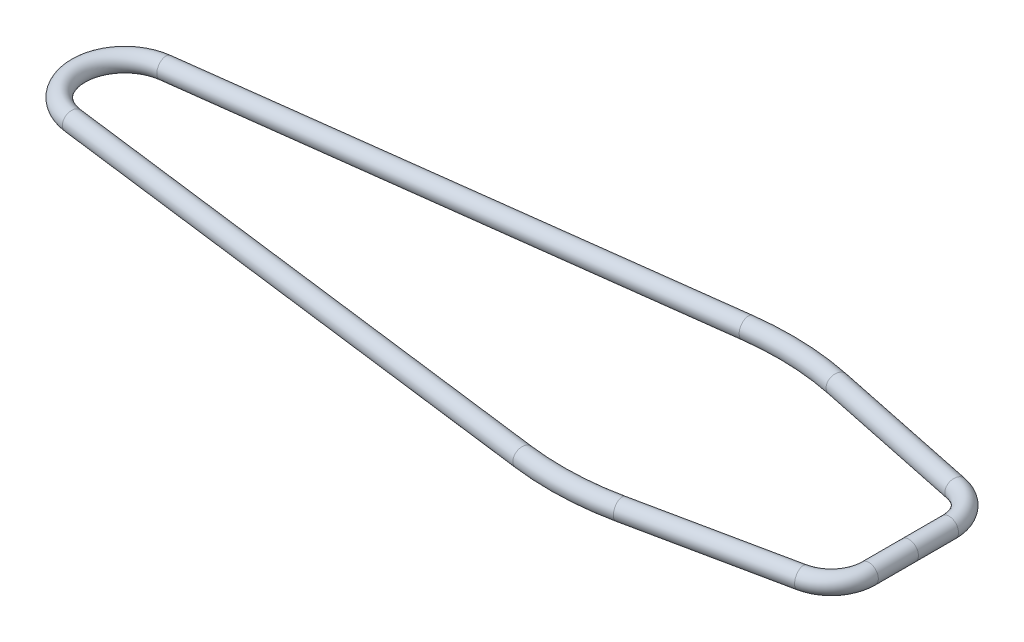
ISO-10303-21;
HEADER;
FILE_DESCRIPTION(('STEP AP214'),'2;1');
FILE_NAME('part.step','',(''),(''),'','','');
FILE_SCHEMA(('AUTOMOTIVE_DESIGN { 1 0 10303 214 1 1 1 1 }'));
ENDSEC;
DATA;
#1=APPLICATION_CONTEXT('core data for automotive mechanical design processes');
#2=APPLICATION_PROTOCOL_DEFINITION('international standard','automotive_design',2000,#1);
#3=PRODUCT_CONTEXT('',#1,'mechanical');
#4=PRODUCT('Part','Part','',(#3));
#5=PRODUCT_RELATED_PRODUCT_CATEGORY('part','',(#4));
#6=PRODUCT_DEFINITION_FORMATION('','',#4);
#7=PRODUCT_DEFINITION_CONTEXT('part definition',#1,'design');
#8=PRODUCT_DEFINITION('design','',#6,#7);
#9=PRODUCT_DEFINITION_SHAPE('','',#8);
#10=(LENGTH_UNIT() NAMED_UNIT(*) SI_UNIT(.MILLI.,.METRE.));
#11=(NAMED_UNIT(*) PLANE_ANGLE_UNIT() SI_UNIT($,.RADIAN.));
#12=(NAMED_UNIT(*) SI_UNIT($,.STERADIAN.) SOLID_ANGLE_UNIT());
#13=UNCERTAINTY_MEASURE_WITH_UNIT(LENGTH_MEASURE(1.E-05),#10,'distance_accuracy_value','');
#14=(GEOMETRIC_REPRESENTATION_CONTEXT(3) GLOBAL_UNCERTAINTY_ASSIGNED_CONTEXT((#13)) GLOBAL_UNIT_ASSIGNED_CONTEXT((#10,
#11,#12)) REPRESENTATION_CONTEXT('',''));
#15=CARTESIAN_POINT('',(0.,0.,0.));
#16=DIRECTION('',(0.,0.,1.));
#17=DIRECTION('',(1.,0.,0.));
#18=AXIS2_PLACEMENT_3D('',#15,#16,#17);
#19=CARTESIAN_POINT('',(1055.18469048996,0.,-53.9426121546441));
#20=DIRECTION('',(0.,0.,1.));
#21=DIRECTION('',(1.,0.,0.));
#22=AXIS2_PLACEMENT_3D('',#19,#20,#21);
#23=CYLINDRICAL_SURFACE('',#22,12.6999999999999);
#24=CARTESIAN_POINT('',(1055.18469048996,0.,0.));
#25=DIRECTION('',(0.,0.,1.));
#26=DIRECTION('',(1.,0.,0.));
#27=AXIS2_PLACEMENT_3D('',#24,#25,#26);
#28=CIRCLE('',#27,12.6999999999999);
#29=CARTESIAN_POINT('',(1067.88469048996,0.,0.));
#30=VERTEX_POINT('',#29);
#31=EDGE_CURVE('E47',#30,#30,#28,.T.);
#32=ORIENTED_EDGE('',*,*,#31,.F.);
#33=EDGE_LOOP('',(#32));
#34=FACE_BOUND('',#33,.T.);
#35=CARTESIAN_POINT('',(1055.18469048996,0.,-53.9426121546442));
#36=DIRECTION('',(0.,0.,1.));
#37=DIRECTION('',(1.,0.,0.));
#38=AXIS2_PLACEMENT_3D('',#35,#36,#37);
#39=CIRCLE('',#38,12.6999999999999);
#40=CARTESIAN_POINT('',(1067.88469048996,0.,-53.9426121546443));
#41=VERTEX_POINT('',#40);
#42=EDGE_CURVE('E34',#41,#41,#39,.T.);
#43=ORIENTED_EDGE('',*,*,#42,.T.);
#44=EDGE_LOOP('',(#43));
#45=FACE_BOUND('',#44,.T.);
#46=ADVANCED_FACE('F31',(#34,#45),#23,.T.);
#47=CARTESIAN_POINT('',(1004.38469048996,0.,-53.9426121546441));
#48=DIRECTION('',(0.,-1.,0.));
#49=DIRECTION('',(0.,0.,-1.));
#50=AXIS2_PLACEMENT_3D('',#47,#48,#49);
#51=TOROIDAL_SURFACE('',#50,50.8,12.6999999999999);
#52=CARTESIAN_POINT('',(1014.74556659885,0.,-103.674817477314));
#53=DIRECTION('',(0.978980419737605,0.,0.203954254112002));
#54=DIRECTION('',(0.203954254112002,0.,-0.978980419737605));
#55=AXIS2_PLACEMENT_3D('',#52,#53,#54);
#56=CIRCLE('',#55,12.6999999999999);
#57=CARTESIAN_POINT('',(1017.33578562607,0.,-116.107868807982));
#58=VERTEX_POINT('',#57);
#59=EDGE_CURVE('E73',#58,#58,#56,.T.);
#60=CARTESIAN_POINT('',(1004.38469048996,0.,-53.9426121546441));
#61=DIRECTION('',(0.,-1.,0.));
#62=DIRECTION('',(0.,0.,-1.));
#63=AXIS2_PLACEMENT_3D('',#60,#61,#62);
#64=CIRCLE('',#63,63.4999999999999);
#65=EDGE_CURVE('',#58,#41,#64,.T.);
#66=ORIENTED_EDGE('',*,*,#59,.T.);
#67=ORIENTED_EDGE('',*,*,#42,.F.);
#68=ORIENTED_EDGE('',*,*,#65,.T.);
#69=ORIENTED_EDGE('',*,*,#65,.F.);
#70=EDGE_LOOP('',(#66,#68,#67,#69));
#71=FACE_BOUND('',#70,.T.);
#72=ADVANCED_FACE('F206',(#71),#51,.T.);
#73=CARTESIAN_POINT('',(812.955493844012,0.,-145.714415967905));
#74=DIRECTION('',(0.978980419737605,0.,0.203954254112002));
#75=DIRECTION('',(0.203954254112002,0.,-0.978980419737605));
#76=AXIS2_PLACEMENT_3D('',#73,#74,#75);
#77=CYLINDRICAL_SURFACE('',#76,12.6999999999999);
#78=ORIENTED_EDGE('',*,*,#59,.F.);
#79=EDGE_LOOP('',(#78));
#80=FACE_BOUND('',#79,.T.);
#81=CARTESIAN_POINT('',(812.955493844012,0.,-145.714415967905));
#82=DIRECTION('',(0.978980419737605,0.,0.203954254112001));
#83=DIRECTION('',(0.203954254112001,0.,-0.978980419737605));
#84=AXIS2_PLACEMENT_3D('',#81,#82,#83);
#85=CIRCLE('',#84,12.6999999999999);
#86=CARTESIAN_POINT('',(815.545712871234,0.,-158.147467298572));
#87=VERTEX_POINT('',#86);
#88=EDGE_CURVE('E71',#87,#87,#85,.T.);
#89=ORIENTED_EDGE('',*,*,#88,.T.);
#90=EDGE_LOOP('',(#89));
#91=FACE_BOUND('',#90,.T.);
#92=ADVANCED_FACE('F203',(#80,#91),#77,.T.);
#93=CARTESIAN_POINT('',(735.248923027339,0.,227.277123952123));
#94=DIRECTION('',(0.,-1.,0.));
#95=DIRECTION('',(0.,0.,-1.));
#96=AXIS2_PLACEMENT_3D('',#93,#94,#95);
#97=TOROIDAL_SURFACE('',#96,381.,12.6999999999999);
#98=CARTESIAN_POINT('',(686.98532115147,0.,-150.653590245556));
#99=DIRECTION('',(0.991944131752438,0.,-0.126676120409106));
#100=DIRECTION('',(-0.126676120409106,0.,-0.991944131752438));
#101=AXIS2_PLACEMENT_3D('',#98,#99,#100);
#102=CIRCLE('',#101,12.6999999999999);
#103=CARTESIAN_POINT('',(685.376534422274,0.,-163.251280718812));
#104=VERTEX_POINT('',#103);
#105=EDGE_CURVE('E68',#104,#104,#102,.T.);
#106=CARTESIAN_POINT('',(735.248923027339,0.,227.277123952123));
#107=DIRECTION('',(0.,-1.,0.));
#108=DIRECTION('',(0.,0.,-1.));
#109=AXIS2_PLACEMENT_3D('',#106,#107,#108);
#110=CIRCLE('',#109,393.7);
#111=EDGE_CURVE('',#104,#87,#110,.T.);
#112=ORIENTED_EDGE('',*,*,#105,.T.);
#113=ORIENTED_EDGE('',*,*,#88,.F.);
#114=ORIENTED_EDGE('',*,*,#111,.T.);
#115=ORIENTED_EDGE('',*,*,#111,.F.);
#116=EDGE_LOOP('',(#112,#114,#113,#115));
#117=FACE_BOUND('',#116,.T.);
#118=ADVANCED_FACE('F199',(#117),#97,.T.);
#119=CARTESIAN_POINT('',(-7.90652926286595,0.,-61.9125));
#120=DIRECTION('',(0.991944131752438,0.,-0.126676120409106));
#121=DIRECTION('',(-0.126676120409106,0.,-0.991944131752438));
#122=AXIS2_PLACEMENT_3D('',#119,#120,#121);
#123=CYLINDRICAL_SURFACE('',#122,12.6999999999999);
#124=ORIENTED_EDGE('',*,*,#105,.F.);
#125=EDGE_LOOP('',(#124));
#126=FACE_BOUND('',#125,.T.);
#127=CARTESIAN_POINT('',(-7.90652926286595,0.,-61.9125));
#128=DIRECTION('',(0.991944131752438,0.,-0.126676120409107));
#129=DIRECTION('',(-0.126676120409107,0.,-0.991944131752438));
#130=AXIS2_PLACEMENT_3D('',#127,#128,#129);
#131=CIRCLE('',#130,12.6999999999999);
#132=CARTESIAN_POINT('',(-9.51531599206158,0.,-74.5101904732559));
#133=VERTEX_POINT('',#132);
#134=EDGE_CURVE('E65',#133,#133,#131,.T.);
#135=ORIENTED_EDGE('',*,*,#134,.T.);
#136=EDGE_LOOP('',(#135));
#137=FACE_BOUND('',#136,.T.);
#138=ADVANCED_FACE('F195',(#126,#137),#123,.T.);
#139=CARTESIAN_POINT('',(0.,0.,0.));
#140=DIRECTION('',(0.,-1.,0.));
#141=DIRECTION('',(0.,0.,-1.));
#142=AXIS2_PLACEMENT_3D('',#139,#140,#141);
#143=TOROIDAL_SURFACE('',#142,62.4153095100438,12.6999999999999);
#144=CARTESIAN_POINT('',(-7.90652926286595,0.,61.9125));
#145=DIRECTION('',(-0.991944131752438,0.,-0.126676120409107));
#146=DIRECTION('',(-0.126676120409107,0.,0.991944131752438));
#147=AXIS2_PLACEMENT_3D('',#144,#145,#146);
#148=CIRCLE('',#147,12.6999999999999);
#149=CARTESIAN_POINT('',(-9.51531599206158,0.,74.5101904732559));
#150=VERTEX_POINT('',#149);
#151=EDGE_CURVE('E62',#150,#150,#148,.T.);
#152=CARTESIAN_POINT('',(0.,0.,0.));
#153=DIRECTION('',(0.,-1.,0.));
#154=DIRECTION('',(0.,0.,-1.));
#155=AXIS2_PLACEMENT_3D('',#152,#153,#154);
#156=CIRCLE('',#155,75.1153095100436);
#157=EDGE_CURVE('',#150,#133,#156,.T.);
#158=ORIENTED_EDGE('',*,*,#151,.T.);
#159=ORIENTED_EDGE('',*,*,#134,.F.);
#160=ORIENTED_EDGE('',*,*,#157,.T.);
#161=ORIENTED_EDGE('',*,*,#157,.F.);
#162=EDGE_LOOP('',(#158,#160,#159,#161));
#163=FACE_BOUND('',#162,.T.);
#164=ADVANCED_FACE('F191',(#163),#143,.T.);
#165=CARTESIAN_POINT('',(686.98532115147,0.,150.653590245557));
#166=DIRECTION('',(-0.991944131752438,0.,-0.126676120409107));
#167=DIRECTION('',(-0.126676120409107,0.,0.991944131752438));
#168=AXIS2_PLACEMENT_3D('',#165,#166,#167);
#169=CYLINDRICAL_SURFACE('',#168,12.6999999999999);
#170=ORIENTED_EDGE('',*,*,#151,.F.);
#171=EDGE_LOOP('',(#170));
#172=FACE_BOUND('',#171,.T.);
#173=CARTESIAN_POINT('',(686.98532115147,0.,150.653590245557));
#174=DIRECTION('',(-0.991944131752438,0.,-0.126676120409106));
#175=DIRECTION('',(-0.126676120409106,0.,0.991944131752438));
#176=AXIS2_PLACEMENT_3D('',#173,#174,#175);
#177=CIRCLE('',#176,12.6999999999999);
#178=CARTESIAN_POINT('',(685.376534422274,0.,163.251280718812));
#179=VERTEX_POINT('',#178);
#180=EDGE_CURVE('E59',#179,#179,#177,.T.);
#181=ORIENTED_EDGE('',*,*,#180,.T.);
#182=EDGE_LOOP('',(#181));
#183=FACE_BOUND('',#182,.T.);
#184=ADVANCED_FACE('F187',(#172,#183),#169,.T.);
#185=CARTESIAN_POINT('',(735.248923027339,0.,-227.277123952122));
#186=DIRECTION('',(0.,-1.,0.));
#187=DIRECTION('',(0.,0.,-1.));
#188=AXIS2_PLACEMENT_3D('',#185,#186,#187);
#189=TOROIDAL_SURFACE('',#188,381.,12.6999999999999);
#190=CARTESIAN_POINT('',(812.955493844012,0.,145.714415967905));
#191=DIRECTION('',(-0.978980419737605,0.,0.203954254112001));
#192=DIRECTION('',(0.203954254112001,0.,0.978980419737605));
#193=AXIS2_PLACEMENT_3D('',#190,#191,#192);
#194=CIRCLE('',#193,12.6999999999999);
#195=CARTESIAN_POINT('',(815.545712871234,0.,158.147467298573));
#196=VERTEX_POINT('',#195);
#197=EDGE_CURVE('E56',#196,#196,#194,.T.);
#198=CARTESIAN_POINT('',(735.248923027339,0.,-227.277123952122));
#199=DIRECTION('',(0.,-1.,0.));
#200=DIRECTION('',(0.,0.,-1.));
#201=AXIS2_PLACEMENT_3D('',#198,#199,#200);
#202=CIRCLE('',#201,393.7);
#203=EDGE_CURVE('',#196,#179,#202,.T.);
#204=ORIENTED_EDGE('',*,*,#197,.T.);
#205=ORIENTED_EDGE('',*,*,#180,.F.);
#206=ORIENTED_EDGE('',*,*,#203,.T.);
#207=ORIENTED_EDGE('',*,*,#203,.F.);
#208=EDGE_LOOP('',(#204,#206,#205,#207));
#209=FACE_BOUND('',#208,.T.);
#210=ADVANCED_FACE('F183',(#209),#189,.T.);
#211=CARTESIAN_POINT('',(1014.74556659885,0.,103.674817477315));
#212=DIRECTION('',(-0.978980419737605,0.,0.203954254112001));
#213=DIRECTION('',(0.203954254112001,0.,0.978980419737605));
#214=AXIS2_PLACEMENT_3D('',#211,#212,#213);
#215=CYLINDRICAL_SURFACE('',#214,12.6999999999999);
#216=ORIENTED_EDGE('',*,*,#197,.F.);
#217=EDGE_LOOP('',(#216));
#218=FACE_BOUND('',#217,.T.);
#219=CARTESIAN_POINT('',(1014.74556659885,0.,103.674817477315));
#220=DIRECTION('',(-0.978980419737605,0.,0.203954254112004));
#221=DIRECTION('',(0.203954254112004,0.,0.978980419737605));
#222=AXIS2_PLACEMENT_3D('',#219,#220,#221);
#223=CIRCLE('',#222,12.6999999999999);
#224=CARTESIAN_POINT('',(1017.33578562607,0.,116.107868807982));
#225=VERTEX_POINT('',#224);
#226=EDGE_CURVE('E53',#225,#225,#223,.T.);
#227=ORIENTED_EDGE('',*,*,#226,.T.);
#228=EDGE_LOOP('',(#227));
#229=FACE_BOUND('',#228,.T.);
#230=ADVANCED_FACE('F179',(#218,#229),#215,.T.);
#231=CARTESIAN_POINT('',(1004.38469048996,0.,53.9426121546446));
#232=DIRECTION('',(0.,-1.,0.));
#233=DIRECTION('',(0.,0.,-1.));
#234=AXIS2_PLACEMENT_3D('',#231,#232,#233);
#235=TOROIDAL_SURFACE('',#234,50.8,12.6999999999999);
#236=CARTESIAN_POINT('',(1055.18469048996,0.,53.9426121546446));
#237=DIRECTION('',(0.,0.,1.));
#238=DIRECTION('',(1.,0.,0.));
#239=AXIS2_PLACEMENT_3D('',#236,#237,#238);
#240=CIRCLE('',#239,12.6999999999999);
#241=CARTESIAN_POINT('',(1067.88469048996,0.,53.9426121546446));
#242=VERTEX_POINT('',#241);
#243=EDGE_CURVE('E50',#242,#242,#240,.T.);
#244=CARTESIAN_POINT('',(1004.38469048996,0.,53.9426121546446));
#245=DIRECTION('',(0.,-1.,0.));
#246=DIRECTION('',(0.,0.,-1.));
#247=AXIS2_PLACEMENT_3D('',#244,#245,#246);
#248=CIRCLE('',#247,63.4999999999998);
#249=EDGE_CURVE('',#242,#225,#248,.T.);
#250=ORIENTED_EDGE('',*,*,#243,.T.);
#251=ORIENTED_EDGE('',*,*,#226,.F.);
#252=ORIENTED_EDGE('',*,*,#249,.T.);
#253=ORIENTED_EDGE('',*,*,#249,.F.);
#254=EDGE_LOOP('',(#250,#252,#251,#253));
#255=FACE_BOUND('',#254,.T.);
#256=ADVANCED_FACE('F175',(#255),#235,.T.);
#257=CARTESIAN_POINT('',(1055.18469048996,0.,0.));
#258=DIRECTION('',(0.,0.,1.));
#259=DIRECTION('',(1.,0.,0.));
#260=AXIS2_PLACEMENT_3D('',#257,#258,#259);
#261=CYLINDRICAL_SURFACE('',#260,12.6999999999999);
#262=ORIENTED_EDGE('',*,*,#243,.F.);
#263=EDGE_LOOP('',(#262));
#264=FACE_BOUND('',#263,.T.);
#265=ORIENTED_EDGE('',*,*,#31,.T.);
#266=EDGE_LOOP('',(#265));
#267=FACE_BOUND('',#266,.T.);
#268=ADVANCED_FACE('F173',(#264,#267),#261,.T.);
#269=CLOSED_SHELL('',(#46,#72,#92,#118,#138,#164,#184,#210,#230,#256,#268));
#270=CARTESIAN_POINT('',(1055.18469048996,0.,-53.9426121546441));
#271=DIRECTION('',(0.,0.,1.));
#272=DIRECTION('',(1.,0.,0.));
#273=AXIS2_PLACEMENT_3D('',#270,#271,#272);
#274=CYLINDRICAL_SURFACE('',#273,11.1125000000001);
#275=CARTESIAN_POINT('',(1055.18469048996,0.,0.));
#276=DIRECTION('',(0.,0.,1.));
#277=DIRECTION('',(1.,0.,0.));
#278=AXIS2_PLACEMENT_3D('',#275,#276,#277);
#279=CIRCLE('',#278,11.1125000000001);
#280=CARTESIAN_POINT('',(1066.29719048996,0.,0.));
#281=VERTEX_POINT('',#280);
#282=EDGE_CURVE('E78',#281,#281,#279,.F.);
#283=ORIENTED_EDGE('',*,*,#282,.F.);
#284=EDGE_LOOP('',(#283));
#285=FACE_BOUND('',#284,.T.);
#286=CARTESIAN_POINT('',(1055.18469048996,0.,-53.9426121546442));
#287=DIRECTION('',(0.,0.,1.));
#288=DIRECTION('',(1.,0.,0.));
#289=AXIS2_PLACEMENT_3D('',#286,#287,#288);
#290=CIRCLE('',#289,11.1125000000001);
#291=CARTESIAN_POINT('',(1066.29719048996,0.,-53.9426121546442));
#292=VERTEX_POINT('',#291);
#293=EDGE_CURVE('E10',#292,#292,#290,.F.);
#294=ORIENTED_EDGE('',*,*,#293,.T.);
#295=EDGE_LOOP('',(#294));
#296=FACE_BOUND('',#295,.T.);
#297=ADVANCED_FACE('F159',(#285,#296),#274,.F.);
#298=CARTESIAN_POINT('',(1004.38469048996,0.,-53.9426121546441));
#299=DIRECTION('',(0.,-1.,0.));
#300=DIRECTION('',(0.,0.,-1.));
#301=AXIS2_PLACEMENT_3D('',#298,#299,#300);
#302=TOROIDAL_SURFACE('',#301,50.8,11.1125000000001);
#303=CARTESIAN_POINT('',(1014.74556659885,0.,-103.674817477314));
#304=DIRECTION('',(0.978980419737605,0.,0.203954254112002));
#305=DIRECTION('',(0.203954254112002,0.,-0.978980419737605));
#306=AXIS2_PLACEMENT_3D('',#303,#304,#305);
#307=CIRCLE('',#306,11.1125000000001);
#308=CARTESIAN_POINT('',(1017.01200824767,0.,-114.553737391649));
#309=VERTEX_POINT('',#308);
#310=EDGE_CURVE('E38',#309,#309,#307,.F.);
#311=CARTESIAN_POINT('',(1004.38469048996,0.,-53.9426121546441));
#312=DIRECTION('',(0.,-1.,0.));
#313=DIRECTION('',(0.,0.,-1.));
#314=AXIS2_PLACEMENT_3D('',#311,#312,#313);
#315=CIRCLE('',#314,61.9125000000001);
#316=EDGE_CURVE('',#309,#292,#315,.T.);
#317=ORIENTED_EDGE('',*,*,#310,.T.);
#318=ORIENTED_EDGE('',*,*,#293,.F.);
#319=ORIENTED_EDGE('',*,*,#316,.T.);
#320=ORIENTED_EDGE('',*,*,#316,.F.);
#321=EDGE_LOOP('',(#317,#319,#318,#320));
#322=FACE_BOUND('',#321,.T.);
#323=ADVANCED_FACE('F162',(#322),#302,.F.);
#324=CARTESIAN_POINT('',(812.955493844012,0.,-145.714415967905));
#325=DIRECTION('',(0.978980419737605,0.,0.203954254112002));
#326=DIRECTION('',(0.203954254112002,0.,-0.978980419737605));
#327=AXIS2_PLACEMENT_3D('',#324,#325,#326);
#328=CYLINDRICAL_SURFACE('',#327,11.1125000000001);
#329=ORIENTED_EDGE('',*,*,#310,.F.);
#330=EDGE_LOOP('',(#329));
#331=FACE_BOUND('',#330,.T.);
#332=CARTESIAN_POINT('',(812.955493844012,0.,-145.714415967905));
#333=DIRECTION('',(0.978980419737605,0.,0.203954254112001));
#334=DIRECTION('',(0.203954254112001,0.,-0.978980419737605));
#335=AXIS2_PLACEMENT_3D('',#332,#333,#334);
#336=CIRCLE('',#335,11.1125000000001);
#337=CARTESIAN_POINT('',(815.221935492832,0.,-156.593335882239));
#338=VERTEX_POINT('',#337);
#339=EDGE_CURVE('E43',#338,#338,#336,.F.);
#340=ORIENTED_EDGE('',*,*,#339,.T.);
#341=EDGE_LOOP('',(#340));
#342=FACE_BOUND('',#341,.T.);
#343=ADVANCED_FACE('F109',(#331,#342),#328,.F.);
#344=CARTESIAN_POINT('',(735.248923027339,0.,227.277123952123));
#345=DIRECTION('',(0.,-1.,0.));
#346=DIRECTION('',(0.,0.,-1.));
#347=AXIS2_PLACEMENT_3D('',#344,#345,#346);
#348=TOROIDAL_SURFACE('',#347,381.,11.1125000000001);
#349=CARTESIAN_POINT('',(686.98532115147,0.,-150.653590245556));
#350=DIRECTION('',(0.991944131752438,0.,-0.126676120409106));
#351=DIRECTION('',(-0.126676120409106,0.,-0.991944131752438));
#352=AXIS2_PLACEMENT_3D('',#349,#350,#351);
#353=CIRCLE('',#352,11.1125000000001);
#354=CARTESIAN_POINT('',(685.577632763424,0.,-161.676569409655));
#355=VERTEX_POINT('',#354);
#356=EDGE_CURVE('E104',#355,#355,#353,.F.);
#357=CARTESIAN_POINT('',(735.248923027339,0.,227.277123952123));
#358=DIRECTION('',(0.,-1.,0.));
#359=DIRECTION('',(0.,0.,-1.));
#360=AXIS2_PLACEMENT_3D('',#357,#358,#359);
#361=CIRCLE('',#360,392.1125);
#362=EDGE_CURVE('',#355,#338,#361,.T.);
#363=ORIENTED_EDGE('',*,*,#356,.T.);
#364=ORIENTED_EDGE('',*,*,#339,.F.);
#365=ORIENTED_EDGE('',*,*,#362,.T.);
#366=ORIENTED_EDGE('',*,*,#362,.F.);
#367=EDGE_LOOP('',(#363,#365,#364,#366));
#368=FACE_BOUND('',#367,.T.);
#369=ADVANCED_FACE('F111',(#368),#348,.F.);
#370=CARTESIAN_POINT('',(-7.90652926286595,0.,-61.9125));
#371=DIRECTION('',(0.991944131752438,0.,-0.126676120409106));
#372=DIRECTION('',(-0.126676120409106,0.,-0.991944131752438));
#373=AXIS2_PLACEMENT_3D('',#370,#371,#372);
#374=CYLINDRICAL_SURFACE('',#373,11.1125000000001);
#375=ORIENTED_EDGE('',*,*,#356,.F.);
#376=EDGE_LOOP('',(#375));
#377=FACE_BOUND('',#376,.T.);
#378=CARTESIAN_POINT('',(-7.90652926286595,0.,-61.9125));
#379=DIRECTION('',(0.991944131752438,0.,-0.126676120409107));
#380=DIRECTION('',(-0.126676120409107,0.,-0.991944131752438));
#381=AXIS2_PLACEMENT_3D('',#378,#379,#380);
#382=CIRCLE('',#381,11.1125000000001);
#383=CARTESIAN_POINT('',(-9.31421765091215,0.,-72.9354791640991));
#384=VERTEX_POINT('',#383);
#385=EDGE_CURVE('E101',#384,#384,#382,.F.);
#386=ORIENTED_EDGE('',*,*,#385,.T.);
#387=EDGE_LOOP('',(#386));
#388=FACE_BOUND('',#387,.T.);
#389=ADVANCED_FACE('F114',(#377,#388),#374,.F.);
#390=CARTESIAN_POINT('',(0.,0.,0.));
#391=DIRECTION('',(0.,-1.,0.));
#392=DIRECTION('',(0.,0.,-1.));
#393=AXIS2_PLACEMENT_3D('',#390,#391,#392);
#394=TOROIDAL_SURFACE('',#393,62.4153095100438,11.1125000000001);
#395=CARTESIAN_POINT('',(-7.90652926286595,0.,61.9125));
#396=DIRECTION('',(-0.991944131752438,0.,-0.126676120409107));
#397=DIRECTION('',(-0.126676120409107,0.,0.991944131752438));
#398=AXIS2_PLACEMENT_3D('',#395,#396,#397);
#399=CIRCLE('',#398,11.1125000000001);
#400=CARTESIAN_POINT('',(-9.31421765091215,0.,72.9354791640991));
#401=VERTEX_POINT('',#400);
#402=EDGE_CURVE('E98',#401,#401,#399,.F.);
#403=CARTESIAN_POINT('',(0.,0.,0.));
#404=DIRECTION('',(0.,-1.,0.));
#405=DIRECTION('',(0.,0.,-1.));
#406=AXIS2_PLACEMENT_3D('',#403,#404,#405);
#407=CIRCLE('',#406,73.5278095100438);
#408=EDGE_CURVE('',#401,#384,#407,.T.);
#409=ORIENTED_EDGE('',*,*,#402,.T.);
#410=ORIENTED_EDGE('',*,*,#385,.F.);
#411=ORIENTED_EDGE('',*,*,#408,.T.);
#412=ORIENTED_EDGE('',*,*,#408,.F.);
#413=EDGE_LOOP('',(#409,#411,#410,#412));
#414=FACE_BOUND('',#413,.T.);
#415=ADVANCED_FACE('F121',(#414),#394,.F.);
#416=CARTESIAN_POINT('',(686.98532115147,0.,150.653590245557));
#417=DIRECTION('',(-0.991944131752438,0.,-0.126676120409107));
#418=DIRECTION('',(-0.126676120409107,0.,0.991944131752438));
#419=AXIS2_PLACEMENT_3D('',#416,#417,#418);
#420=CYLINDRICAL_SURFACE('',#419,11.1125000000001);
#421=ORIENTED_EDGE('',*,*,#402,.F.);
#422=EDGE_LOOP('',(#421));
#423=FACE_BOUND('',#422,.T.);
#424=CARTESIAN_POINT('',(686.98532115147,0.,150.653590245557));
#425=DIRECTION('',(-0.991944131752438,0.,-0.126676120409106));
#426=DIRECTION('',(-0.126676120409106,0.,0.991944131752438));
#427=AXIS2_PLACEMENT_3D('',#424,#425,#426);
#428=CIRCLE('',#427,11.1125000000001);
#429=CARTESIAN_POINT('',(685.577632763424,0.,161.676569409656));
#430=VERTEX_POINT('',#429);
#431=EDGE_CURVE('E95',#430,#430,#428,.F.);
#432=ORIENTED_EDGE('',*,*,#431,.T.);
#433=EDGE_LOOP('',(#432));
#434=FACE_BOUND('',#433,.T.);
#435=ADVANCED_FACE('F127',(#423,#434),#420,.F.);
#436=CARTESIAN_POINT('',(735.248923027339,0.,-227.277123952122));
#437=DIRECTION('',(0.,-1.,0.));
#438=DIRECTION('',(0.,0.,-1.));
#439=AXIS2_PLACEMENT_3D('',#436,#437,#438);
#440=TOROIDAL_SURFACE('',#439,381.,11.1125000000001);
#441=CARTESIAN_POINT('',(812.955493844012,0.,145.714415967905));
#442=DIRECTION('',(-0.978980419737605,0.,0.203954254112001));
#443=DIRECTION('',(0.203954254112001,0.,0.978980419737605));
#444=AXIS2_PLACEMENT_3D('',#441,#442,#443);
#445=CIRCLE('',#444,11.1125000000001);
#446=CARTESIAN_POINT('',(815.221935492832,0.,156.59333588224));
#447=VERTEX_POINT('',#446);
#448=EDGE_CURVE('E92',#447,#447,#445,.F.);
#449=CARTESIAN_POINT('',(735.248923027339,0.,-227.277123952122));
#450=DIRECTION('',(0.,-1.,0.));
#451=DIRECTION('',(0.,0.,-1.));
#452=AXIS2_PLACEMENT_3D('',#449,#450,#451);
#453=CIRCLE('',#452,392.1125);
#454=EDGE_CURVE('',#447,#430,#453,.T.);
#455=ORIENTED_EDGE('',*,*,#448,.T.);
#456=ORIENTED_EDGE('',*,*,#431,.F.);
#457=ORIENTED_EDGE('',*,*,#454,.T.);
#458=ORIENTED_EDGE('',*,*,#454,.F.);
#459=EDGE_LOOP('',(#455,#457,#456,#458));
#460=FACE_BOUND('',#459,.T.);
#461=ADVANCED_FACE('F133',(#460),#440,.F.);
#462=CARTESIAN_POINT('',(1014.74556659885,0.,103.674817477315));
#463=DIRECTION('',(-0.978980419737605,0.,0.203954254112001));
#464=DIRECTION('',(0.203954254112001,0.,0.978980419737605));
#465=AXIS2_PLACEMENT_3D('',#462,#463,#464);
#466=CYLINDRICAL_SURFACE('',#465,11.1125000000001);
#467=ORIENTED_EDGE('',*,*,#448,.F.);
#468=EDGE_LOOP('',(#467));
#469=FACE_BOUND('',#468,.T.);
#470=CARTESIAN_POINT('',(1014.74556659885,0.,103.674817477315));
#471=DIRECTION('',(-0.978980419737605,0.,0.203954254112004));
#472=DIRECTION('',(0.203954254112004,0.,0.978980419737605));
#473=AXIS2_PLACEMENT_3D('',#470,#471,#472);
#474=CIRCLE('',#473,11.1125000000001);
#475=CARTESIAN_POINT('',(1017.01200824767,0.,114.553737391649));
#476=VERTEX_POINT('',#475);
#477=EDGE_CURVE('E87',#476,#476,#474,.F.);
#478=ORIENTED_EDGE('',*,*,#477,.T.);
#479=EDGE_LOOP('',(#478));
#480=FACE_BOUND('',#479,.T.);
#481=ADVANCED_FACE('F139',(#469,#480),#466,.F.);
#482=CARTESIAN_POINT('',(1004.38469048996,0.,53.9426121546446));
#483=DIRECTION('',(0.,-1.,0.));
#484=DIRECTION('',(0.,0.,-1.));
#485=AXIS2_PLACEMENT_3D('',#482,#483,#484);
#486=TOROIDAL_SURFACE('',#485,50.8,11.1125000000001);
#487=CARTESIAN_POINT('',(1055.18469048996,0.,53.9426121546446));
#488=DIRECTION('',(0.,0.,1.));
#489=DIRECTION('',(1.,0.,0.));
#490=AXIS2_PLACEMENT_3D('',#487,#488,#489);
#491=CIRCLE('',#490,11.1125000000001);
#492=CARTESIAN_POINT('',(1066.29719048996,0.,53.9426121546446));
#493=VERTEX_POINT('',#492);
#494=EDGE_CURVE('E82',#493,#493,#491,.F.);
#495=CARTESIAN_POINT('',(1004.38469048996,0.,53.9426121546446));
#496=DIRECTION('',(0.,-1.,0.));
#497=DIRECTION('',(0.,0.,-1.));
#498=AXIS2_PLACEMENT_3D('',#495,#496,#497);
#499=CIRCLE('',#498,61.9125);
#500=EDGE_CURVE('',#493,#476,#499,.T.);
#501=ORIENTED_EDGE('',*,*,#494,.T.);
#502=ORIENTED_EDGE('',*,*,#477,.F.);
#503=ORIENTED_EDGE('',*,*,#500,.T.);
#504=ORIENTED_EDGE('',*,*,#500,.F.);
#505=EDGE_LOOP('',(#501,#503,#502,#504));
#506=FACE_BOUND('',#505,.T.);
#507=ADVANCED_FACE('F145',(#506),#486,.F.);
#508=CARTESIAN_POINT('',(1055.18469048996,0.,0.));
#509=DIRECTION('',(0.,0.,1.));
#510=DIRECTION('',(1.,0.,0.));
#511=AXIS2_PLACEMENT_3D('',#508,#509,#510);
#512=CYLINDRICAL_SURFACE('',#511,11.1125000000001);
#513=ORIENTED_EDGE('',*,*,#494,.F.);
#514=EDGE_LOOP('',(#513));
#515=FACE_BOUND('',#514,.T.);
#516=ORIENTED_EDGE('',*,*,#282,.T.);
#517=EDGE_LOOP('',(#516));
#518=FACE_BOUND('',#517,.T.);
#519=ADVANCED_FACE('F151',(#515,#518),#512,.F.);
#520=CLOSED_SHELL('',(#297,#323,#343,#369,#389,#415,#435,#461,#481,#507,#519));
#521=ORIENTED_CLOSED_SHELL('',*,#520,.T.);
#522=BREP_WITH_VOIDS('B2',#269,(#521));
#523=ADVANCED_BREP_SHAPE_REPRESENTATION('',(#18,#522),#14);
#524=SHAPE_DEFINITION_REPRESENTATION(#9,#523);
ENDSEC;
END-ISO-10303-21;
